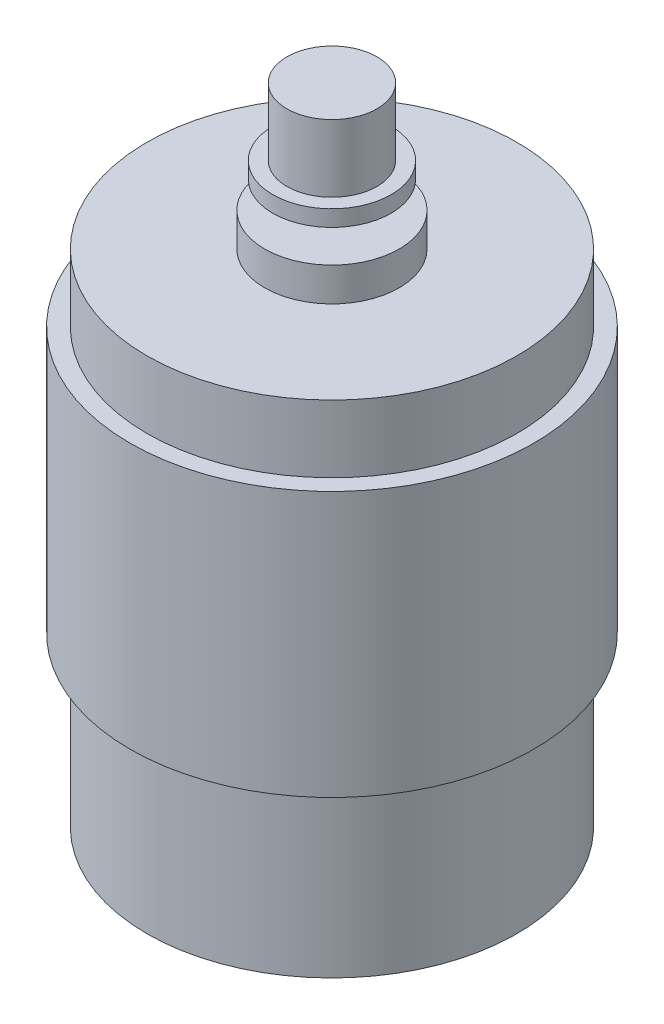
ISO-10303-21;
HEADER;
FILE_DESCRIPTION(('STEP AP214'),'2;1');
FILE_NAME('part.step','',(''),(''),'','','');
FILE_SCHEMA(('AUTOMOTIVE_DESIGN { 1 0 10303 214 1 1 1 1 }'));
ENDSEC;
DATA;
#1=APPLICATION_CONTEXT('core data for automotive mechanical design processes');
#2=APPLICATION_PROTOCOL_DEFINITION('international standard','automotive_design',2000,#1);
#3=PRODUCT_CONTEXT('',#1,'mechanical');
#4=PRODUCT('Part','Part','',(#3));
#5=PRODUCT_RELATED_PRODUCT_CATEGORY('part','',(#4));
#6=PRODUCT_DEFINITION_FORMATION('','',#4);
#7=PRODUCT_DEFINITION_CONTEXT('part definition',#1,'design');
#8=PRODUCT_DEFINITION('design','',#6,#7);
#9=PRODUCT_DEFINITION_SHAPE('','',#8);
#10=(LENGTH_UNIT() NAMED_UNIT(*) SI_UNIT(.MILLI.,.METRE.));
#11=(NAMED_UNIT(*) PLANE_ANGLE_UNIT() SI_UNIT($,.RADIAN.));
#12=(NAMED_UNIT(*) SI_UNIT($,.STERADIAN.) SOLID_ANGLE_UNIT());
#13=UNCERTAINTY_MEASURE_WITH_UNIT(LENGTH_MEASURE(1.E-05),#10,'distance_accuracy_value','');
#14=(GEOMETRIC_REPRESENTATION_CONTEXT(3) GLOBAL_UNCERTAINTY_ASSIGNED_CONTEXT((#13)) GLOBAL_UNIT_ASSIGNED_CONTEXT((#10,
#11,#12)) REPRESENTATION_CONTEXT('',''));
#15=CARTESIAN_POINT('',(0.,0.,0.));
#16=DIRECTION('',(0.,0.,1.));
#17=DIRECTION('',(1.,0.,0.));
#18=AXIS2_PLACEMENT_3D('',#15,#16,#17);
#19=CARTESIAN_POINT('',(0.,12.5,0.));
#20=DIRECTION('',(0.,-1.,0.));
#21=DIRECTION('',(0.,0.,-1.));
#22=AXIS2_PLACEMENT_3D('',#19,#20,#21);
#23=CYLINDRICAL_SURFACE('',#22,13.75);
#24=CARTESIAN_POINT('',(0.,12.5,0.));
#25=DIRECTION('',(0.,1.,0.));
#26=DIRECTION('',(0.,0.,1.));
#27=AXIS2_PLACEMENT_3D('',#24,#25,#26);
#28=CIRCLE('',#27,13.75);
#29=CARTESIAN_POINT('',(0.,12.5,13.75));
#30=VERTEX_POINT('',#29);
#31=EDGE_CURVE('E69',#30,#30,#28,.T.);
#32=ORIENTED_EDGE('',*,*,#31,.F.);
#33=EDGE_LOOP('',(#32));
#34=FACE_BOUND('',#33,.T.);
#35=CARTESIAN_POINT('',(0.,0.,0.));
#36=DIRECTION('',(0.,1.,0.));
#37=DIRECTION('',(0.,0.,1.));
#38=AXIS2_PLACEMENT_3D('',#35,#36,#37);
#39=CIRCLE('',#38,13.75);
#40=CARTESIAN_POINT('',(0.,0.,13.75));
#41=VERTEX_POINT('',#40);
#42=EDGE_CURVE('E34',#41,#41,#39,.T.);
#43=ORIENTED_EDGE('',*,*,#42,.T.);
#44=EDGE_LOOP('',(#43));
#45=FACE_BOUND('',#44,.T.);
#46=ADVANCED_FACE('F31',(#34,#45),#23,.T.);
#47=CARTESIAN_POINT('',(0.,0.,0.));
#48=DIRECTION('',(0.,1.,0.));
#49=DIRECTION('',(0.,0.,1.));
#50=AXIS2_PLACEMENT_3D('',#47,#48,#49);
#51=PLANE('',#50);
#52=ORIENTED_EDGE('',*,*,#42,.F.);
#53=EDGE_LOOP('',(#52));
#54=FACE_BOUND('',#53,.T.);
#55=ADVANCED_FACE('F81',(#54),#51,.F.);
#56=CARTESIAN_POINT('',(0.,32.2,0.));
#57=DIRECTION('',(0.,-1.,0.));
#58=DIRECTION('',(0.,0.,-1.));
#59=AXIS2_PLACEMENT_3D('',#56,#57,#58);
#60=CYLINDRICAL_SURFACE('',#59,15.);
#61=CARTESIAN_POINT('',(0.,32.2,0.));
#62=DIRECTION('',(0.,1.,0.));
#63=DIRECTION('',(0.,0.,1.));
#64=AXIS2_PLACEMENT_3D('',#61,#62,#63);
#65=CIRCLE('',#64,15.);
#66=CARTESIAN_POINT('',(0.,32.2,15.));
#67=VERTEX_POINT('',#66);
#68=EDGE_CURVE('E70',#67,#67,#65,.T.);
#69=ORIENTED_EDGE('',*,*,#68,.F.);
#70=EDGE_LOOP('',(#69));
#71=FACE_BOUND('',#70,.T.);
#72=CARTESIAN_POINT('',(0.,12.5,0.));
#73=DIRECTION('',(0.,1.,0.));
#74=DIRECTION('',(0.,0.,1.));
#75=AXIS2_PLACEMENT_3D('',#72,#73,#74);
#76=CIRCLE('',#75,15.);
#77=CARTESIAN_POINT('',(0.,12.5,15.));
#78=VERTEX_POINT('',#77);
#79=EDGE_CURVE('E66',#78,#78,#76,.T.);
#80=ORIENTED_EDGE('',*,*,#79,.T.);
#81=EDGE_LOOP('',(#80));
#82=FACE_BOUND('',#81,.T.);
#83=ADVANCED_FACE('F83',(#71,#82),#60,.T.);
#84=CARTESIAN_POINT('',(0.,32.2,0.));
#85=DIRECTION('',(0.,1.,0.));
#86=DIRECTION('',(0.,0.,1.));
#87=AXIS2_PLACEMENT_3D('',#84,#85,#86);
#88=PLANE('',#87);
#89=CARTESIAN_POINT('',(0.,32.2,0.));
#90=DIRECTION('',(0.,1.,0.));
#91=DIRECTION('',(0.,0.,1.));
#92=AXIS2_PLACEMENT_3D('',#89,#90,#91);
#93=CIRCLE('',#92,13.75);
#94=CARTESIAN_POINT('',(0.,32.2,13.75));
#95=VERTEX_POINT('',#94);
#96=EDGE_CURVE('E63',#95,#95,#93,.T.);
#97=ORIENTED_EDGE('',*,*,#96,.F.);
#98=EDGE_LOOP('',(#97));
#99=FACE_BOUND('',#98,.T.);
#100=ORIENTED_EDGE('',*,*,#68,.T.);
#101=EDGE_LOOP('',(#100));
#102=FACE_BOUND('',#101,.T.);
#103=ADVANCED_FACE('F88',(#99,#102),#88,.T.);
#104=CARTESIAN_POINT('',(0.,12.5,0.));
#105=DIRECTION('',(0.,1.,0.));
#106=DIRECTION('',(0.,0.,1.));
#107=AXIS2_PLACEMENT_3D('',#104,#105,#106);
#108=PLANE('',#107);
#109=ORIENTED_EDGE('',*,*,#31,.T.);
#110=EDGE_LOOP('',(#109));
#111=FACE_BOUND('',#110,.T.);
#112=ORIENTED_EDGE('',*,*,#79,.F.);
#113=EDGE_LOOP('',(#112));
#114=FACE_BOUND('',#113,.T.);
#115=ADVANCED_FACE('F93',(#111,#114),#108,.F.);
#116=CARTESIAN_POINT('',(0.,37.2,0.));
#117=DIRECTION('',(0.,-1.,0.));
#118=DIRECTION('',(0.,0.,-1.));
#119=AXIS2_PLACEMENT_3D('',#116,#117,#118);
#120=CYLINDRICAL_SURFACE('',#119,13.75);
#121=CARTESIAN_POINT('',(0.,37.2,0.));
#122=DIRECTION('',(0.,1.,0.));
#123=DIRECTION('',(0.,0.,1.));
#124=AXIS2_PLACEMENT_3D('',#121,#122,#123);
#125=CIRCLE('',#124,13.75);
#126=CARTESIAN_POINT('',(0.,37.2,13.75));
#127=VERTEX_POINT('',#126);
#128=EDGE_CURVE('E60',#127,#127,#125,.T.);
#129=ORIENTED_EDGE('',*,*,#128,.F.);
#130=EDGE_LOOP('',(#129));
#131=FACE_BOUND('',#130,.T.);
#132=ORIENTED_EDGE('',*,*,#96,.T.);
#133=EDGE_LOOP('',(#132));
#134=FACE_BOUND('',#133,.T.);
#135=ADVANCED_FACE('F96',(#131,#134),#120,.T.);
#136=CARTESIAN_POINT('',(0.,37.2,0.));
#137=DIRECTION('',(0.,1.,0.));
#138=DIRECTION('',(0.,0.,1.));
#139=AXIS2_PLACEMENT_3D('',#136,#137,#138);
#140=PLANE('',#139);
#141=CARTESIAN_POINT('',(0.,37.2,0.));
#142=DIRECTION('',(0.,1.,0.));
#143=DIRECTION('',(0.,0.,1.));
#144=AXIS2_PLACEMENT_3D('',#141,#142,#143);
#145=CIRCLE('',#144,5.);
#146=CARTESIAN_POINT('',(0.,37.2,5.));
#147=VERTEX_POINT('',#146);
#148=EDGE_CURVE('E43',#147,#147,#145,.T.);
#149=ORIENTED_EDGE('',*,*,#148,.F.);
#150=EDGE_LOOP('',(#149));
#151=FACE_BOUND('',#150,.T.);
#152=ORIENTED_EDGE('',*,*,#128,.T.);
#153=EDGE_LOOP('',(#152));
#154=FACE_BOUND('',#153,.T.);
#155=ADVANCED_FACE('F102',(#151,#154),#140,.T.);
#156=CARTESIAN_POINT('',(0.,39.7,0.));
#157=DIRECTION('',(0.,-1.,0.));
#158=DIRECTION('',(0.,0.,-1.));
#159=AXIS2_PLACEMENT_3D('',#156,#157,#158);
#160=CYLINDRICAL_SURFACE('',#159,5.);
#161=CARTESIAN_POINT('',(0.,39.7,0.));
#162=DIRECTION('',(0.,1.,0.));
#163=DIRECTION('',(0.,0.,1.));
#164=AXIS2_PLACEMENT_3D('',#161,#162,#163);
#165=CIRCLE('',#164,5.);
#166=CARTESIAN_POINT('',(0.,39.7,5.));
#167=VERTEX_POINT('',#166);
#168=EDGE_CURVE('E56',#167,#167,#165,.T.);
#169=ORIENTED_EDGE('',*,*,#168,.F.);
#170=EDGE_LOOP('',(#169));
#171=FACE_BOUND('',#170,.T.);
#172=ORIENTED_EDGE('',*,*,#148,.T.);
#173=EDGE_LOOP('',(#172));
#174=FACE_BOUND('',#173,.T.);
#175=ADVANCED_FACE('F106',(#171,#174),#160,.T.);
#176=CARTESIAN_POINT('',(0.,39.7,0.));
#177=DIRECTION('',(0.,1.,0.));
#178=DIRECTION('',(0.,0.,1.));
#179=AXIS2_PLACEMENT_3D('',#176,#177,#178);
#180=PLANE('',#179);
#181=CARTESIAN_POINT('',(0.,39.7,0.));
#182=DIRECTION('',(0.,1.,0.));
#183=DIRECTION('',(0.,0.,1.));
#184=AXIS2_PLACEMENT_3D('',#181,#182,#183);
#185=CIRCLE('',#184,1.15);
#186=CARTESIAN_POINT('',(0.,39.7,1.15));
#187=VERTEX_POINT('',#186);
#188=EDGE_CURVE('E38',#187,#187,#185,.T.);
#189=ORIENTED_EDGE('',*,*,#188,.F.);
#190=EDGE_LOOP('',(#189));
#191=FACE_BOUND('',#190,.T.);
#192=ORIENTED_EDGE('',*,*,#168,.T.);
#193=EDGE_LOOP('',(#192));
#194=FACE_BOUND('',#193,.T.);
#195=ADVANCED_FACE('F110',(#191,#194),#180,.T.);
#196=CARTESIAN_POINT('',(0.,41.7,0.));
#197=DIRECTION('',(0.,-1.,0.));
#198=DIRECTION('',(0.,0.,-1.));
#199=AXIS2_PLACEMENT_3D('',#196,#197,#198);
#200=CYLINDRICAL_SURFACE('',#199,1.15);
#201=CARTESIAN_POINT('',(0.,41.7,0.));
#202=DIRECTION('',(0.,1.,0.));
#203=DIRECTION('',(0.,0.,1.));
#204=AXIS2_PLACEMENT_3D('',#201,#202,#203);
#205=CIRCLE('',#204,1.15);
#206=CARTESIAN_POINT('',(0.,41.7,1.15));
#207=VERTEX_POINT('',#206);
#208=EDGE_CURVE('E51',#207,#207,#205,.T.);
#209=ORIENTED_EDGE('',*,*,#208,.F.);
#210=EDGE_LOOP('',(#209));
#211=FACE_BOUND('',#210,.T.);
#212=ORIENTED_EDGE('',*,*,#188,.T.);
#213=EDGE_LOOP('',(#212));
#214=FACE_BOUND('',#213,.T.);
#215=ADVANCED_FACE('F114',(#211,#214),#200,.T.);
#216=CARTESIAN_POINT('',(0.,42.9,0.));
#217=DIRECTION('',(0.,-1.,0.));
#218=DIRECTION('',(0.,0.,-1.));
#219=AXIS2_PLACEMENT_3D('',#216,#217,#218);
#220=CYLINDRICAL_SURFACE('',#219,4.4);
#221=CARTESIAN_POINT('',(0.,42.9,0.));
#222=DIRECTION('',(0.,1.,0.));
#223=DIRECTION('',(0.,0.,1.));
#224=AXIS2_PLACEMENT_3D('',#221,#222,#223);
#225=CIRCLE('',#224,4.4);
#226=CARTESIAN_POINT('',(0.,42.9,4.4));
#227=VERTEX_POINT('',#226);
#228=EDGE_CURVE('E48',#227,#227,#225,.T.);
#229=ORIENTED_EDGE('',*,*,#228,.F.);
#230=EDGE_LOOP('',(#229));
#231=FACE_BOUND('',#230,.T.);
#232=CARTESIAN_POINT('',(0.,41.7,0.));
#233=DIRECTION('',(0.,1.,0.));
#234=DIRECTION('',(0.,0.,1.));
#235=AXIS2_PLACEMENT_3D('',#232,#233,#234);
#236=CIRCLE('',#235,4.4);
#237=CARTESIAN_POINT('',(0.,41.7,4.4));
#238=VERTEX_POINT('',#237);
#239=EDGE_CURVE('E52',#238,#238,#236,.T.);
#240=ORIENTED_EDGE('',*,*,#239,.T.);
#241=EDGE_LOOP('',(#240));
#242=FACE_BOUND('',#241,.T.);
#243=ADVANCED_FACE('F118',(#231,#242),#220,.T.);
#244=CARTESIAN_POINT('',(0.,42.9,0.));
#245=DIRECTION('',(0.,1.,0.));
#246=DIRECTION('',(0.,0.,1.));
#247=AXIS2_PLACEMENT_3D('',#244,#245,#246);
#248=PLANE('',#247);
#249=CARTESIAN_POINT('',(0.,42.9,0.));
#250=DIRECTION('',(0.,1.,0.));
#251=DIRECTION('',(0.,0.,1.));
#252=AXIS2_PLACEMENT_3D('',#249,#250,#251);
#253=CIRCLE('',#252,3.35);
#254=CARTESIAN_POINT('',(0.,42.9,3.35));
#255=VERTEX_POINT('',#254);
#256=EDGE_CURVE('E10',#255,#255,#253,.T.);
#257=ORIENTED_EDGE('',*,*,#256,.F.);
#258=EDGE_LOOP('',(#257));
#259=FACE_BOUND('',#258,.T.);
#260=ORIENTED_EDGE('',*,*,#228,.T.);
#261=EDGE_LOOP('',(#260));
#262=FACE_BOUND('',#261,.T.);
#263=ADVANCED_FACE('F122',(#259,#262),#248,.T.);
#264=CARTESIAN_POINT('',(0.,41.7,0.));
#265=DIRECTION('',(0.,1.,0.));
#266=DIRECTION('',(0.,0.,1.));
#267=AXIS2_PLACEMENT_3D('',#264,#265,#266);
#268=PLANE('',#267);
#269=ORIENTED_EDGE('',*,*,#208,.T.);
#270=EDGE_LOOP('',(#269));
#271=FACE_BOUND('',#270,.T.);
#272=ORIENTED_EDGE('',*,*,#239,.F.);
#273=EDGE_LOOP('',(#272));
#274=FACE_BOUND('',#273,.T.);
#275=ADVANCED_FACE('F124',(#271,#274),#268,.F.);
#276=CARTESIAN_POINT('',(0.,47.9,0.));
#277=DIRECTION('',(0.,-1.,0.));
#278=DIRECTION('',(0.,0.,-1.));
#279=AXIS2_PLACEMENT_3D('',#276,#277,#278);
#280=CYLINDRICAL_SURFACE('',#279,3.35);
#281=CARTESIAN_POINT('',(0.,47.9,0.));
#282=DIRECTION('',(0.,1.,0.));
#283=DIRECTION('',(0.,0.,1.));
#284=AXIS2_PLACEMENT_3D('',#281,#282,#283);
#285=CIRCLE('',#284,3.35);
#286=CARTESIAN_POINT('',(0.,47.9,3.35));
#287=VERTEX_POINT('',#286);
#288=EDGE_CURVE('E47',#287,#287,#285,.T.);
#289=ORIENTED_EDGE('',*,*,#288,.F.);
#290=EDGE_LOOP('',(#289));
#291=FACE_BOUND('',#290,.T.);
#292=ORIENTED_EDGE('',*,*,#256,.T.);
#293=EDGE_LOOP('',(#292));
#294=FACE_BOUND('',#293,.T.);
#295=ADVANCED_FACE('F127',(#291,#294),#280,.T.);
#296=CARTESIAN_POINT('',(0.,47.9,0.));
#297=DIRECTION('',(0.,1.,0.));
#298=DIRECTION('',(0.,0.,1.));
#299=AXIS2_PLACEMENT_3D('',#296,#297,#298);
#300=PLANE('',#299);
#301=ORIENTED_EDGE('',*,*,#288,.T.);
#302=EDGE_LOOP('',(#301));
#303=FACE_BOUND('',#302,.T.);
#304=ADVANCED_FACE('F134',(#303),#300,.T.);
#305=CLOSED_SHELL('',(#46,#55,#83,#103,#115,#135,#155,#175,#195,#215,#243,#263,#275,#295,#304));
#306=MANIFOLD_SOLID_BREP('B2',#305);
#307=ADVANCED_BREP_SHAPE_REPRESENTATION('',(#18,#306),#14);
#308=SHAPE_DEFINITION_REPRESENTATION(#9,#307);
ENDSEC;
END-ISO-10303-21;
